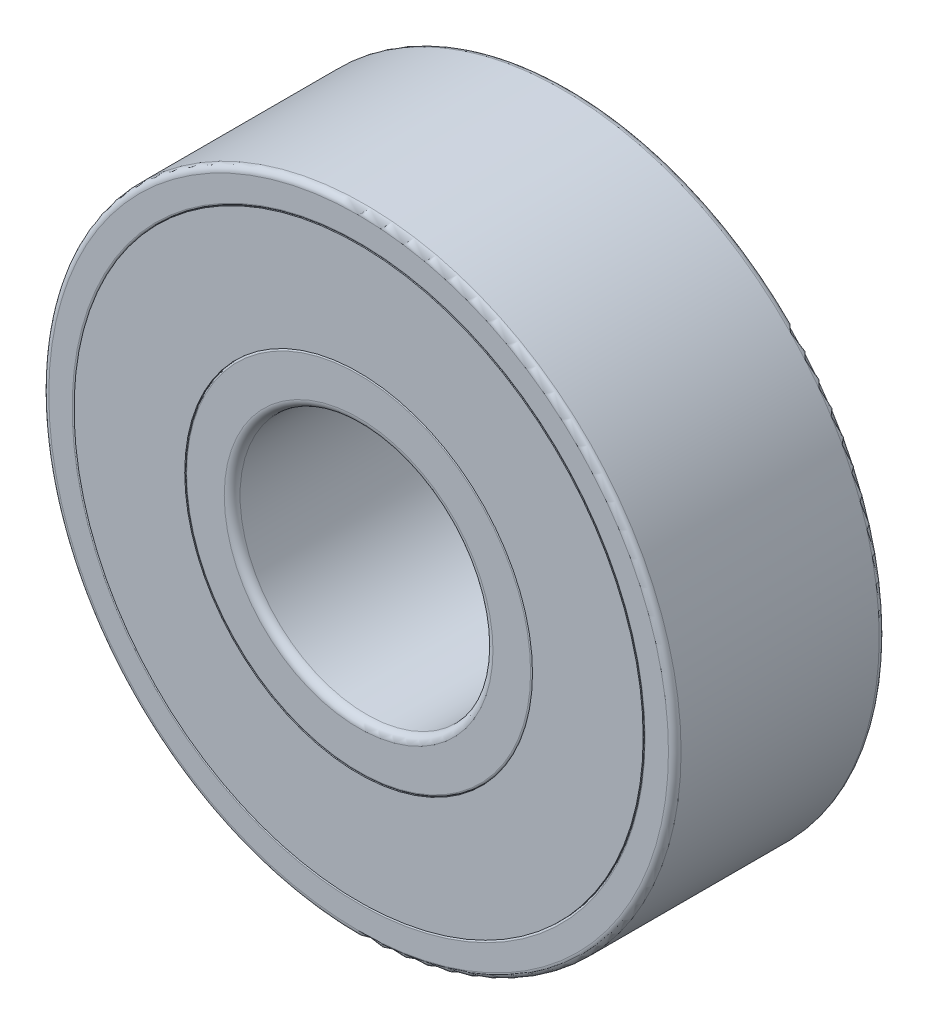
ISO-10303-21;
HEADER;
FILE_DESCRIPTION(('STEP AP214'),'2;1');
FILE_NAME('part.step','',(''),(''),'','','');
FILE_SCHEMA(('AUTOMOTIVE_DESIGN { 1 0 10303 214 1 1 1 1 }'));
ENDSEC;
DATA;
#1=APPLICATION_CONTEXT('core data for automotive mechanical design processes');
#2=APPLICATION_PROTOCOL_DEFINITION('international standard','automotive_design',2000,#1);
#3=PRODUCT_CONTEXT('',#1,'mechanical');
#4=PRODUCT('Part','Part','',(#3));
#5=PRODUCT_RELATED_PRODUCT_CATEGORY('part','',(#4));
#6=PRODUCT_DEFINITION_FORMATION('','',#4);
#7=PRODUCT_DEFINITION_CONTEXT('part definition',#1,'design');
#8=PRODUCT_DEFINITION('design','',#6,#7);
#9=PRODUCT_DEFINITION_SHAPE('','',#8);
#10=(LENGTH_UNIT() NAMED_UNIT(*) SI_UNIT(.MILLI.,.METRE.));
#11=(NAMED_UNIT(*) PLANE_ANGLE_UNIT() SI_UNIT($,.RADIAN.));
#12=(NAMED_UNIT(*) SI_UNIT($,.STERADIAN.) SOLID_ANGLE_UNIT());
#13=UNCERTAINTY_MEASURE_WITH_UNIT(LENGTH_MEASURE(1.E-05),#10,'distance_accuracy_value','');
#14=(GEOMETRIC_REPRESENTATION_CONTEXT(3) GLOBAL_UNCERTAINTY_ASSIGNED_CONTEXT((#13)) GLOBAL_UNIT_ASSIGNED_CONTEXT((#10,
#11,#12)) REPRESENTATION_CONTEXT('',''));
#15=CARTESIAN_POINT('',(0.,0.,0.));
#16=DIRECTION('',(0.,0.,1.));
#17=DIRECTION('',(1.,0.,0.));
#18=AXIS2_PLACEMENT_3D('',#15,#16,#17);
#19=CARTESIAN_POINT('',(0.,0.,2.5));
#20=DIRECTION('',(0.,0.,1.));
#21=DIRECTION('',(1.,0.,0.));
#22=AXIS2_PLACEMENT_3D('',#19,#20,#21);
#23=PLANE('',#22);
#24=CARTESIAN_POINT('',(0.,0.,2.5));
#25=DIRECTION('',(0.,0.,1.));
#26=DIRECTION('',(1.,0.,0.));
#27=AXIS2_PLACEMENT_3D('',#24,#25,#26);
#28=CIRCLE('',#27,6.75);
#29=CARTESIAN_POINT('',(6.75,0.,2.5));
#30=VERTEX_POINT('',#29);
#31=EDGE_CURVE('E11',#30,#30,#28,.T.);
#32=ORIENTED_EDGE('',*,*,#31,.T.);
#33=EDGE_LOOP('',(#32));
#34=FACE_BOUND('',#33,.T.);
#35=CARTESIAN_POINT('',(0.,0.,2.5));
#36=DIRECTION('',(0.,0.,1.));
#37=DIRECTION('',(1.,0.,0.));
#38=AXIS2_PLACEMENT_3D('',#35,#36,#37);
#39=CIRCLE('',#38,4.125);
#40=CARTESIAN_POINT('',(4.125,0.,2.5));
#41=VERTEX_POINT('',#40);
#42=EDGE_CURVE('E55',#41,#41,#39,.T.);
#43=ORIENTED_EDGE('',*,*,#42,.F.);
#44=EDGE_LOOP('',(#43));
#45=FACE_BOUND('',#44,.T.);
#46=ADVANCED_FACE('F44',(#34,#45),#23,.T.);
#47=CARTESIAN_POINT('',(0.,0.,-2.5));
#48=DIRECTION('',(0.,0.,1.));
#49=DIRECTION('',(1.,0.,0.));
#50=AXIS2_PLACEMENT_3D('',#47,#48,#49);
#51=PLANE('',#50);
#52=CARTESIAN_POINT('',(0.,0.,-2.5));
#53=DIRECTION('',(0.,0.,1.));
#54=DIRECTION('',(1.,0.,0.));
#55=AXIS2_PLACEMENT_3D('',#52,#53,#54);
#56=CIRCLE('',#55,6.75);
#57=CARTESIAN_POINT('',(6.75,0.,-2.5));
#58=VERTEX_POINT('',#57);
#59=EDGE_CURVE('E48',#58,#58,#56,.T.);
#60=ORIENTED_EDGE('',*,*,#59,.F.);
#61=EDGE_LOOP('',(#60));
#62=FACE_BOUND('',#61,.T.);
#63=CARTESIAN_POINT('',(0.,0.,-2.5));
#64=DIRECTION('',(0.,0.,1.));
#65=DIRECTION('',(1.,0.,0.));
#66=AXIS2_PLACEMENT_3D('',#63,#64,#65);
#67=CIRCLE('',#66,4.125);
#68=CARTESIAN_POINT('',(4.125,0.,-2.5));
#69=VERTEX_POINT('',#68);
#70=EDGE_CURVE('E57',#69,#69,#67,.T.);
#71=ORIENTED_EDGE('',*,*,#70,.T.);
#72=EDGE_LOOP('',(#71));
#73=FACE_BOUND('',#72,.T.);
#74=ADVANCED_FACE('F67',(#62,#73),#51,.F.);
#75=CARTESIAN_POINT('',(0.,0.,2.5));
#76=DIRECTION('',(0.,0.,-1.));
#77=DIRECTION('',(-1.,0.,0.));
#78=AXIS2_PLACEMENT_3D('',#75,#76,#77);
#79=CYLINDRICAL_SURFACE('',#78,6.75);
#80=ORIENTED_EDGE('',*,*,#31,.F.);
#81=EDGE_LOOP('',(#80));
#82=FACE_BOUND('',#81,.T.);
#83=ORIENTED_EDGE('',*,*,#59,.T.);
#84=EDGE_LOOP('',(#83));
#85=FACE_BOUND('',#84,.T.);
#86=ADVANCED_FACE('F46',(#82,#85),#79,.T.);
#87=CARTESIAN_POINT('',(0.,0.,2.5));
#88=DIRECTION('',(0.,0.,-1.));
#89=DIRECTION('',(-1.,0.,0.));
#90=AXIS2_PLACEMENT_3D('',#87,#88,#89);
#91=CYLINDRICAL_SURFACE('',#90,4.125);
#92=ORIENTED_EDGE('',*,*,#42,.T.);
#93=EDGE_LOOP('',(#92));
#94=FACE_BOUND('',#93,.T.);
#95=ORIENTED_EDGE('',*,*,#70,.F.);
#96=EDGE_LOOP('',(#95));
#97=FACE_BOUND('',#96,.T.);
#98=ADVANCED_FACE('F63',(#94,#97),#91,.F.);
#99=CLOSED_SHELL('',(#46,#74,#86,#98));
#100=MANIFOLD_SOLID_BREP('B2',#99);
#101=CARTESIAN_POINT('',(4.25120868591987,-3.39022579760692,0.));
#102=DIRECTION('',(-0.781831482468022,0.623489801858743,0.));
#103=DIRECTION('',(0.,0.,-1.));
#104=AXIS2_PLACEMENT_3D('',#101,#102,#103);
#105=SPHERICAL_SURFACE('',#104,1.575);
#106=CARTESIAN_POINT('',(3.01982410103274,-2.4082293596794,0.));
#107=VERTEX_POINT('',#106);
#108=VERTEX_LOOP('',#107);
#109=FACE_BOUND('',#108,.T.);
#110=ADVANCED_FACE('F112',(#109),#105,.T.);
#111=CLOSED_SHELL('',(#110));
#112=MANIFOLD_SOLID_BREP('B6',#111);
#113=CARTESIAN_POINT('',(5.30117052248868,1.20995757838741,0.));
#114=DIRECTION('',(-0.974927912181826,-0.222520933956305,0.));
#115=DIRECTION('',(0.,0.,-1.));
#116=AXIS2_PLACEMENT_3D('',#113,#114,#115);
#117=SPHERICAL_SURFACE('',#116,1.575);
#118=CARTESIAN_POINT('',(3.7656590608023,0.859487107406228,0.));
#119=VERTEX_POINT('',#118);
#120=VERTEX_LOOP('',#119);
#121=FACE_BOUND('',#120,.T.);
#122=ADVANCED_FACE('F131',(#121),#117,.T.);
#123=CLOSED_SHELL('',(#122));
#124=MANIFOLD_SOLID_BREP('B40',#123);
#125=CARTESIAN_POINT('',(2.35924283145176,4.89901821921939,0.));
#126=DIRECTION('',(-0.433883739117565,-0.900968867902416,0.));
#127=DIRECTION('',(0.,0.,-1.));
#128=AXIS2_PLACEMENT_3D('',#125,#126,#127);
#129=SPHERICAL_SURFACE('',#128,1.575);
#130=CARTESIAN_POINT('',(1.6758759423416,3.47999225227308,0.));
#131=VERTEX_POINT('',#130);
#132=VERTEX_LOOP('',#131);
#133=FACE_BOUND('',#132,.T.);
#134=ADVANCED_FACE('F150',(#133),#129,.T.);
#135=CLOSED_SHELL('',(#134));
#136=MANIFOLD_SOLID_BREP('B108',#135);
#137=CARTESIAN_POINT('',(-2.35924283145169,4.89901821921942,0.));
#138=DIRECTION('',(0.433883739117553,-0.900968867902422,0.));
#139=DIRECTION('',(0.,0.,-1.));
#140=AXIS2_PLACEMENT_3D('',#137,#138,#139);
#141=SPHERICAL_SURFACE('',#140,1.575);
#142=CARTESIAN_POINT('',(-1.67587594234155,3.4799922522731,0.));
#143=VERTEX_POINT('',#142);
#144=VERTEX_LOOP('',#143);
#145=FACE_BOUND('',#144,.T.);
#146=ADVANCED_FACE('F169',(#145),#141,.T.);
#147=CLOSED_SHELL('',(#146));
#148=MANIFOLD_SOLID_BREP('B127',#147);
#149=CARTESIAN_POINT('',(-5.30117052248866,1.20995757838748,0.));
#150=DIRECTION('',(0.974927912181823,-0.222520933956318,0.));
#151=DIRECTION('',(0.,0.,-1.));
#152=AXIS2_PLACEMENT_3D('',#149,#150,#151);
#153=SPHERICAL_SURFACE('',#152,1.575);
#154=CARTESIAN_POINT('',(-3.76565906080229,0.859487107406279,0.));
#155=VERTEX_POINT('',#154);
#156=VERTEX_LOOP('',#155);
#157=FACE_BOUND('',#156,.T.);
#158=ADVANCED_FACE('F188',(#157),#153,.T.);
#159=CLOSED_SHELL('',(#158));
#160=MANIFOLD_SOLID_BREP('B146',#159);
#161=CARTESIAN_POINT('',(-4.25120868591992,-3.39022579760686,0.));
#162=DIRECTION('',(0.781831482468031,0.623489801858732,0.));
#163=DIRECTION('',(0.,0.,-1.));
#164=AXIS2_PLACEMENT_3D('',#161,#162,#163);
#165=SPHERICAL_SURFACE('',#164,1.575);
#166=CARTESIAN_POINT('',(-3.01982410103277,-2.40822935967935,0.));
#167=VERTEX_POINT('',#166);
#168=VERTEX_LOOP('',#167);
#169=FACE_BOUND('',#168,.T.);
#170=ADVANCED_FACE('F207',(#169),#165,.T.);
#171=CLOSED_SHELL('',(#170));
#172=MANIFOLD_SOLID_BREP('B165',#171);
#173=CARTESIAN_POINT('',(0.,-5.4375,0.));
#174=DIRECTION('',(0.,1.,0.));
#175=DIRECTION('',(0.,0.,-1.));
#176=AXIS2_PLACEMENT_3D('',#173,#174,#175);
#177=SPHERICAL_SURFACE('',#176,1.575);
#178=CARTESIAN_POINT('',(0.,-3.8625,0.));
#179=VERTEX_POINT('',#178);
#180=VERTEX_LOOP('',#179);
#181=FACE_BOUND('',#180,.T.);
#182=ADVANCED_FACE('F228',(#181),#177,.T.);
#183=CLOSED_SHELL('',(#182));
#184=MANIFOLD_SOLID_BREP('B184',#183);
#185=CARTESIAN_POINT('',(0.,0.,2.5));
#186=DIRECTION('',(0.,0.,1.));
#187=DIRECTION('',(1.,0.,0.));
#188=AXIS2_PLACEMENT_3D('',#185,#186,#187);
#189=CYLINDRICAL_SURFACE('',#188,4.125);
#190=CARTESIAN_POINT('',(0.,0.,2.455));
#191=DIRECTION('',(0.,0.,1.));
#192=DIRECTION('',(1.,0.,0.));
#193=AXIS2_PLACEMENT_3D('',#190,#191,#192);
#194=CIRCLE('',#193,4.125);
#195=CARTESIAN_POINT('',(4.125,0.,2.455));
#196=VERTEX_POINT('',#195);
#197=EDGE_CURVE('E227',#196,#196,#194,.F.);
#198=ORIENTED_EDGE('',*,*,#197,.T.);
#199=EDGE_LOOP('',(#198));
#200=FACE_BOUND('',#199,.T.);
#201=CARTESIAN_POINT('',(0.,0.,0.870614007468293));
#202=DIRECTION('',(0.,0.,-1.));
#203=DIRECTION('',(-1.,0.,0.));
#204=AXIS2_PLACEMENT_3D('',#201,#202,#203);
#205=CIRCLE('',#204,4.125);
#206=CARTESIAN_POINT('',(-4.125,0.,0.870614007468293));
#207=VERTEX_POINT('',#206);
#208=EDGE_CURVE('E280',#207,#207,#205,.T.);
#209=ORIENTED_EDGE('',*,*,#208,.F.);
#210=EDGE_LOOP('',(#209));
#211=FACE_BOUND('',#210,.T.);
#212=ADVANCED_FACE('F248',(#200,#211),#189,.T.);
#213=CARTESIAN_POINT('',(0.,-4.125,2.5));
#214=DIRECTION('',(0.,0.,1.));
#215=DIRECTION('',(1.,0.,0.));
#216=AXIS2_PLACEMENT_3D('',#213,#214,#215);
#217=PLANE('',#216);
#218=CARTESIAN_POINT('',(0.,0.,2.5));
#219=DIRECTION('',(0.,0.,1.));
#220=DIRECTION('',(1.,0.,0.));
#221=AXIS2_PLACEMENT_3D('',#218,#219,#220);
#222=CIRCLE('',#221,4.08);
#223=CARTESIAN_POINT('',(4.08,0.,2.5));
#224=VERTEX_POINT('',#223);
#225=EDGE_CURVE('E255',#224,#224,#222,.T.);
#226=ORIENTED_EDGE('',*,*,#225,.T.);
#227=EDGE_LOOP('',(#226));
#228=FACE_BOUND('',#227,.T.);
#229=CARTESIAN_POINT('',(0.,0.,2.5));
#230=DIRECTION('',(0.,0.,1.));
#231=DIRECTION('',(1.,0.,0.));
#232=AXIS2_PLACEMENT_3D('',#229,#230,#231);
#233=CIRCLE('',#232,3.1875);
#234=CARTESIAN_POINT('',(3.1875,0.,2.5));
#235=VERTEX_POINT('',#234);
#236=EDGE_CURVE('E268',#235,#235,#233,.F.);
#237=ORIENTED_EDGE('',*,*,#236,.T.);
#238=EDGE_LOOP('',(#237));
#239=FACE_BOUND('',#238,.T.);
#240=ADVANCED_FACE('F305',(#228,#239),#217,.T.);
#241=CARTESIAN_POINT('',(0.,0.,2.5));
#242=DIRECTION('',(0.,0.,1.));
#243=DIRECTION('',(1.,0.,0.));
#244=AXIS2_PLACEMENT_3D('',#241,#242,#243);
#245=CYLINDRICAL_SURFACE('',#244,3.);
#246=CARTESIAN_POINT('',(0.,0.,-2.3125));
#247=DIRECTION('',(0.,0.,-1.));
#248=DIRECTION('',(-1.,0.,0.));
#249=AXIS2_PLACEMENT_3D('',#246,#247,#248);
#250=CIRCLE('',#249,3.);
#251=CARTESIAN_POINT('',(-3.,0.,-2.3125));
#252=VERTEX_POINT('',#251);
#253=EDGE_CURVE('E271',#252,#252,#250,.T.);
#254=ORIENTED_EDGE('',*,*,#253,.T.);
#255=EDGE_LOOP('',(#254));
#256=FACE_BOUND('',#255,.T.);
#257=CARTESIAN_POINT('',(0.,0.,2.3125));
#258=DIRECTION('',(0.,0.,1.));
#259=DIRECTION('',(1.,0.,0.));
#260=AXIS2_PLACEMENT_3D('',#257,#258,#259);
#261=CIRCLE('',#260,3.);
#262=CARTESIAN_POINT('',(3.,0.,2.3125));
#263=VERTEX_POINT('',#262);
#264=EDGE_CURVE('E274',#263,#263,#261,.T.);
#265=ORIENTED_EDGE('',*,*,#264,.T.);
#266=EDGE_LOOP('',(#265));
#267=FACE_BOUND('',#266,.T.);
#268=ADVANCED_FACE('F301',(#256,#267),#245,.F.);
#269=CARTESIAN_POINT('',(0.,-4.125,-2.5));
#270=DIRECTION('',(0.,0.,-1.));
#271=DIRECTION('',(-1.,0.,0.));
#272=AXIS2_PLACEMENT_3D('',#269,#270,#271);
#273=PLANE('',#272);
#274=CARTESIAN_POINT('',(0.,0.,-2.5));
#275=DIRECTION('',(0.,0.,-1.));
#276=DIRECTION('',(-1.,0.,0.));
#277=AXIS2_PLACEMENT_3D('',#274,#275,#276);
#278=CIRCLE('',#277,4.08);
#279=CARTESIAN_POINT('',(-4.08,0.,-2.5));
#280=VERTEX_POINT('',#279);
#281=EDGE_CURVE('E259',#280,#280,#278,.T.);
#282=ORIENTED_EDGE('',*,*,#281,.T.);
#283=EDGE_LOOP('',(#282));
#284=FACE_BOUND('',#283,.T.);
#285=CARTESIAN_POINT('',(0.,0.,-2.5));
#286=DIRECTION('',(0.,0.,-1.));
#287=DIRECTION('',(-1.,0.,0.));
#288=AXIS2_PLACEMENT_3D('',#285,#286,#287);
#289=CIRCLE('',#288,3.1875);
#290=CARTESIAN_POINT('',(-3.1875,0.,-2.5));
#291=VERTEX_POINT('',#290);
#292=EDGE_CURVE('E277',#291,#291,#289,.F.);
#293=ORIENTED_EDGE('',*,*,#292,.T.);
#294=EDGE_LOOP('',(#293));
#295=FACE_BOUND('',#294,.T.);
#296=ADVANCED_FACE('F291',(#284,#295),#273,.T.);
#297=CARTESIAN_POINT('',(0.,0.,-2.455));
#298=DIRECTION('',(0.,0.,-1.));
#299=DIRECTION('',(-1.,0.,0.));
#300=AXIS2_PLACEMENT_3D('',#297,#298,#299);
#301=CIRCLE('',#300,4.125);
#302=CARTESIAN_POINT('',(-4.125,0.,-2.455));
#303=VERTEX_POINT('',#302);
#304=EDGE_CURVE('E263',#303,#303,#301,.F.);
#305=ORIENTED_EDGE('',*,*,#304,.T.);
#306=EDGE_LOOP('',(#305));
#307=FACE_BOUND('',#306,.T.);
#308=CARTESIAN_POINT('',(0.,0.,-0.870614007468293));
#309=DIRECTION('',(0.,0.,1.));
#310=DIRECTION('',(1.,0.,0.));
#311=AXIS2_PLACEMENT_3D('',#308,#309,#310);
#312=CIRCLE('',#311,4.125);
#313=CARTESIAN_POINT('',(4.125,0.,-0.870614007468293));
#314=VERTEX_POINT('',#313);
#315=EDGE_CURVE('E283',#314,#314,#312,.T.);
#316=ORIENTED_EDGE('',*,*,#315,.F.);
#317=EDGE_LOOP('',(#316));
#318=FACE_BOUND('',#317,.T.);
#319=ADVANCED_FACE('F289',(#307,#318),#189,.T.);
#320=CARTESIAN_POINT('',(0.,0.,0.));
#321=DIRECTION('',(0.,0.,1.));
#322=DIRECTION('',(1.,0.,0.));
#323=AXIS2_PLACEMENT_3D('',#320,#321,#322);
#324=TOROIDAL_SURFACE('',#323,5.4375,1.575);
#325=ORIENTED_EDGE('',*,*,#208,.T.);
#326=EDGE_LOOP('',(#325));
#327=FACE_BOUND('',#326,.T.);
#328=ORIENTED_EDGE('',*,*,#315,.T.);
#329=EDGE_LOOP('',(#328));
#330=FACE_BOUND('',#329,.T.);
#331=ADVANCED_FACE('F287',(#327,#330),#324,.F.);
#332=CARTESIAN_POINT('',(0.,0.,-2.3125));
#333=DIRECTION('',(0.,0.,-1.));
#334=DIRECTION('',(-1.,0.,0.));
#335=AXIS2_PLACEMENT_3D('',#332,#333,#334);
#336=TOROIDAL_SURFACE('',#335,3.1875,0.1875);
#337=ORIENTED_EDGE('',*,*,#253,.F.);
#338=EDGE_LOOP('',(#337));
#339=FACE_BOUND('',#338,.T.);
#340=ORIENTED_EDGE('',*,*,#292,.F.);
#341=EDGE_LOOP('',(#340));
#342=FACE_BOUND('',#341,.T.);
#343=ADVANCED_FACE('F298',(#339,#342),#336,.T.);
#344=CARTESIAN_POINT('',(0.,0.,2.3125));
#345=DIRECTION('',(0.,0.,1.));
#346=DIRECTION('',(1.,0.,0.));
#347=AXIS2_PLACEMENT_3D('',#344,#345,#346);
#348=TOROIDAL_SURFACE('',#347,3.1875,0.1875);
#349=ORIENTED_EDGE('',*,*,#236,.F.);
#350=EDGE_LOOP('',(#349));
#351=FACE_BOUND('',#350,.T.);
#352=ORIENTED_EDGE('',*,*,#264,.F.);
#353=EDGE_LOOP('',(#352));
#354=FACE_BOUND('',#353,.T.);
#355=ADVANCED_FACE('F321',(#351,#354),#348,.T.);
#356=CARTESIAN_POINT('',(0.,0.,-2.455));
#357=DIRECTION('',(0.,0.,-1.));
#358=DIRECTION('',(-1.,0.,0.));
#359=AXIS2_PLACEMENT_3D('',#356,#357,#358);
#360=TOROIDAL_SURFACE('',#359,4.08,0.045);
#361=ORIENTED_EDGE('',*,*,#281,.F.);
#362=EDGE_LOOP('',(#361));
#363=FACE_BOUND('',#362,.T.);
#364=ORIENTED_EDGE('',*,*,#304,.F.);
#365=EDGE_LOOP('',(#364));
#366=FACE_BOUND('',#365,.T.);
#367=ADVANCED_FACE('F324',(#363,#366),#360,.T.);
#368=CARTESIAN_POINT('',(0.,0.,2.455));
#369=DIRECTION('',(0.,0.,1.));
#370=DIRECTION('',(1.,0.,0.));
#371=AXIS2_PLACEMENT_3D('',#368,#369,#370);
#372=TOROIDAL_SURFACE('',#371,4.08,0.045);
#373=ORIENTED_EDGE('',*,*,#197,.F.);
#374=EDGE_LOOP('',(#373));
#375=FACE_BOUND('',#374,.T.);
#376=ORIENTED_EDGE('',*,*,#225,.F.);
#377=EDGE_LOOP('',(#376));
#378=FACE_BOUND('',#377,.T.);
#379=ADVANCED_FACE('F250',(#375,#378),#372,.T.);
#380=CLOSED_SHELL('',(#212,#240,#268,#296,#319,#331,#343,#355,#367,#379));
#381=MANIFOLD_SOLID_BREP('B203',#380);
#382=CARTESIAN_POINT('',(0.,0.,2.5));
#383=DIRECTION('',(0.,0.,1.));
#384=DIRECTION('',(1.,0.,0.));
#385=AXIS2_PLACEMENT_3D('',#382,#383,#384);
#386=CYLINDRICAL_SURFACE('',#385,6.75);
#387=CARTESIAN_POINT('',(0.,0.,2.455));
#388=DIRECTION('',(0.,0.,1.));
#389=DIRECTION('',(1.,0.,0.));
#390=AXIS2_PLACEMENT_3D('',#387,#388,#389);
#391=CIRCLE('',#390,6.75);
#392=CARTESIAN_POINT('',(6.75,0.,2.455));
#393=VERTEX_POINT('',#392);
#394=EDGE_CURVE('E406',#393,#393,#391,.T.);
#395=ORIENTED_EDGE('',*,*,#394,.T.);
#396=EDGE_LOOP('',(#395));
#397=FACE_BOUND('',#396,.T.);
#398=CARTESIAN_POINT('',(0.,0.,0.870614007468294));
#399=DIRECTION('',(0.,0.,-1.));
#400=DIRECTION('',(-1.,0.,0.));
#401=AXIS2_PLACEMENT_3D('',#398,#399,#400);
#402=CIRCLE('',#401,6.75);
#403=CARTESIAN_POINT('',(-6.75,0.,0.870614007468294));
#404=VERTEX_POINT('',#403);
#405=EDGE_CURVE('E431',#404,#404,#402,.F.);
#406=ORIENTED_EDGE('',*,*,#405,.F.);
#407=EDGE_LOOP('',(#406));
#408=FACE_BOUND('',#407,.T.);
#409=ADVANCED_FACE('F399',(#397,#408),#386,.F.);
#410=CARTESIAN_POINT('',(0.,-6.75,2.5));
#411=DIRECTION('',(0.,0.,1.));
#412=DIRECTION('',(1.,0.,0.));
#413=AXIS2_PLACEMENT_3D('',#410,#411,#412);
#414=PLANE('',#413);
#415=CARTESIAN_POINT('',(0.,0.,2.5));
#416=DIRECTION('',(0.,0.,1.));
#417=DIRECTION('',(1.,0.,0.));
#418=AXIS2_PLACEMENT_3D('',#415,#416,#417);
#419=CIRCLE('',#418,6.795);
#420=CARTESIAN_POINT('',(6.795,0.,2.5));
#421=VERTEX_POINT('',#420);
#422=EDGE_CURVE('E247',#421,#421,#419,.F.);
#423=ORIENTED_EDGE('',*,*,#422,.T.);
#424=EDGE_LOOP('',(#423));
#425=FACE_BOUND('',#424,.T.);
#426=CARTESIAN_POINT('',(0.,0.,2.5));
#427=DIRECTION('',(0.,0.,1.));
#428=DIRECTION('',(1.,0.,0.));
#429=AXIS2_PLACEMENT_3D('',#426,#427,#428);
#430=CIRCLE('',#429,7.35);
#431=CARTESIAN_POINT('',(7.35,0.,2.5));
#432=VERTEX_POINT('',#431);
#433=EDGE_CURVE('E419',#432,#432,#430,.T.);
#434=ORIENTED_EDGE('',*,*,#433,.T.);
#435=EDGE_LOOP('',(#434));
#436=FACE_BOUND('',#435,.T.);
#437=ADVANCED_FACE('F456',(#425,#436),#414,.T.);
#438=CARTESIAN_POINT('',(0.,0.,2.5));
#439=DIRECTION('',(0.,0.,1.));
#440=DIRECTION('',(1.,0.,0.));
#441=AXIS2_PLACEMENT_3D('',#438,#439,#440);
#442=CYLINDRICAL_SURFACE('',#441,7.5);
#443=CARTESIAN_POINT('',(0.,0.,-2.35));
#444=DIRECTION('',(0.,0.,-1.));
#445=DIRECTION('',(-1.,0.,0.));
#446=AXIS2_PLACEMENT_3D('',#443,#444,#445);
#447=CIRCLE('',#446,7.5);
#448=CARTESIAN_POINT('',(-7.5,0.,-2.35));
#449=VERTEX_POINT('',#448);
#450=EDGE_CURVE('E425',#449,#449,#447,.F.);
#451=ORIENTED_EDGE('',*,*,#450,.T.);
#452=EDGE_LOOP('',(#451));
#453=FACE_BOUND('',#452,.T.);
#454=CARTESIAN_POINT('',(0.,0.,2.35));
#455=DIRECTION('',(0.,0.,1.));
#456=DIRECTION('',(1.,0.,0.));
#457=AXIS2_PLACEMENT_3D('',#454,#455,#456);
#458=CIRCLE('',#457,7.5);
#459=CARTESIAN_POINT('',(7.5,0.,2.35));
#460=VERTEX_POINT('',#459);
#461=EDGE_CURVE('E428',#460,#460,#458,.F.);
#462=ORIENTED_EDGE('',*,*,#461,.T.);
#463=EDGE_LOOP('',(#462));
#464=FACE_BOUND('',#463,.T.);
#465=ADVANCED_FACE('F452',(#453,#464),#442,.T.);
#466=CARTESIAN_POINT('',(0.,-7.5,-2.5));
#467=DIRECTION('',(0.,0.,-1.));
#468=DIRECTION('',(-1.,0.,0.));
#469=AXIS2_PLACEMENT_3D('',#466,#467,#468);
#470=PLANE('',#469);
#471=CARTESIAN_POINT('',(0.,0.,-2.5));
#472=DIRECTION('',(0.,0.,-1.));
#473=DIRECTION('',(-1.,0.,0.));
#474=AXIS2_PLACEMENT_3D('',#471,#472,#473);
#475=CIRCLE('',#474,6.795);
#476=CARTESIAN_POINT('',(-6.795,0.,-2.5));
#477=VERTEX_POINT('',#476);
#478=EDGE_CURVE('E414',#477,#477,#475,.F.);
#479=ORIENTED_EDGE('',*,*,#478,.T.);
#480=EDGE_LOOP('',(#479));
#481=FACE_BOUND('',#480,.T.);
#482=CARTESIAN_POINT('',(0.,0.,-2.5));
#483=DIRECTION('',(0.,0.,-1.));
#484=DIRECTION('',(-1.,0.,0.));
#485=AXIS2_PLACEMENT_3D('',#482,#483,#484);
#486=CIRCLE('',#485,7.35);
#487=CARTESIAN_POINT('',(-7.35,0.,-2.5));
#488=VERTEX_POINT('',#487);
#489=EDGE_CURVE('E422',#488,#488,#486,.T.);
#490=ORIENTED_EDGE('',*,*,#489,.T.);
#491=EDGE_LOOP('',(#490));
#492=FACE_BOUND('',#491,.T.);
#493=ADVANCED_FACE('F442',(#481,#492),#470,.T.);
#494=CARTESIAN_POINT('',(0.,0.,-2.455));
#495=DIRECTION('',(0.,0.,-1.));
#496=DIRECTION('',(-1.,0.,0.));
#497=AXIS2_PLACEMENT_3D('',#494,#495,#496);
#498=CIRCLE('',#497,6.75);
#499=CARTESIAN_POINT('',(-6.75,0.,-2.455));
#500=VERTEX_POINT('',#499);
#501=EDGE_CURVE('E410',#500,#500,#498,.T.);
#502=ORIENTED_EDGE('',*,*,#501,.T.);
#503=EDGE_LOOP('',(#502));
#504=FACE_BOUND('',#503,.T.);
#505=CARTESIAN_POINT('',(0.,0.,-0.870614007468294));
#506=DIRECTION('',(0.,0.,1.));
#507=DIRECTION('',(1.,0.,0.));
#508=AXIS2_PLACEMENT_3D('',#505,#506,#507);
#509=CIRCLE('',#508,6.75);
#510=CARTESIAN_POINT('',(6.75,0.,-0.870614007468294));
#511=VERTEX_POINT('',#510);
#512=EDGE_CURVE('E434',#511,#511,#509,.F.);
#513=ORIENTED_EDGE('',*,*,#512,.F.);
#514=EDGE_LOOP('',(#513));
#515=FACE_BOUND('',#514,.T.);
#516=ADVANCED_FACE('F440',(#504,#515),#386,.F.);
#517=CARTESIAN_POINT('',(0.,0.,0.));
#518=DIRECTION('',(0.,0.,1.));
#519=DIRECTION('',(1.,0.,0.));
#520=AXIS2_PLACEMENT_3D('',#517,#518,#519);
#521=TOROIDAL_SURFACE('',#520,5.4375,1.575);
#522=ORIENTED_EDGE('',*,*,#405,.T.);
#523=EDGE_LOOP('',(#522));
#524=FACE_BOUND('',#523,.T.);
#525=ORIENTED_EDGE('',*,*,#512,.T.);
#526=EDGE_LOOP('',(#525));
#527=FACE_BOUND('',#526,.T.);
#528=ADVANCED_FACE('F438',(#524,#527),#521,.F.);
#529=CARTESIAN_POINT('',(0.,0.,-2.35));
#530=DIRECTION('',(0.,0.,-1.));
#531=DIRECTION('',(-1.,0.,0.));
#532=AXIS2_PLACEMENT_3D('',#529,#530,#531);
#533=TOROIDAL_SURFACE('',#532,7.35,0.15);
#534=ORIENTED_EDGE('',*,*,#489,.F.);
#535=EDGE_LOOP('',(#534));
#536=FACE_BOUND('',#535,.T.);
#537=ORIENTED_EDGE('',*,*,#450,.F.);
#538=EDGE_LOOP('',(#537));
#539=FACE_BOUND('',#538,.T.);
#540=ADVANCED_FACE('F449',(#536,#539),#533,.T.);
#541=CARTESIAN_POINT('',(0.,0.,2.35));
#542=DIRECTION('',(0.,0.,1.));
#543=DIRECTION('',(1.,0.,0.));
#544=AXIS2_PLACEMENT_3D('',#541,#542,#543);
#545=TOROIDAL_SURFACE('',#544,7.35,0.15);
#546=ORIENTED_EDGE('',*,*,#461,.F.);
#547=EDGE_LOOP('',(#546));
#548=FACE_BOUND('',#547,.T.);
#549=ORIENTED_EDGE('',*,*,#433,.F.);
#550=EDGE_LOOP('',(#549));
#551=FACE_BOUND('',#550,.T.);
#552=ADVANCED_FACE('F472',(#548,#551),#545,.T.);
#553=CARTESIAN_POINT('',(0.,0.,-2.455));
#554=DIRECTION('',(0.,0.,-1.));
#555=DIRECTION('',(-1.,0.,0.));
#556=AXIS2_PLACEMENT_3D('',#553,#554,#555);
#557=TOROIDAL_SURFACE('',#556,6.795,0.045);
#558=ORIENTED_EDGE('',*,*,#501,.F.);
#559=EDGE_LOOP('',(#558));
#560=FACE_BOUND('',#559,.T.);
#561=ORIENTED_EDGE('',*,*,#478,.F.);
#562=EDGE_LOOP('',(#561));
#563=FACE_BOUND('',#562,.T.);
#564=ADVANCED_FACE('F475',(#560,#563),#557,.T.);
#565=CARTESIAN_POINT('',(0.,0.,2.455));
#566=DIRECTION('',(0.,0.,1.));
#567=DIRECTION('',(1.,0.,0.));
#568=AXIS2_PLACEMENT_3D('',#565,#566,#567);
#569=TOROIDAL_SURFACE('',#568,6.795,0.045);
#570=ORIENTED_EDGE('',*,*,#422,.F.);
#571=EDGE_LOOP('',(#570));
#572=FACE_BOUND('',#571,.T.);
#573=ORIENTED_EDGE('',*,*,#394,.F.);
#574=EDGE_LOOP('',(#573));
#575=FACE_BOUND('',#574,.T.);
#576=ADVANCED_FACE('F401',(#572,#575),#569,.T.);
#577=CLOSED_SHELL('',(#409,#437,#465,#493,#516,#528,#540,#552,#564,#576));
#578=MANIFOLD_SOLID_BREP('B222',#577);
#579=ADVANCED_BREP_SHAPE_REPRESENTATION('',(#18,#100,#112,#124,#136,#148,#160,#172,#184,#381,
#578),#14);
#580=SHAPE_DEFINITION_REPRESENTATION(#9,#579);
ENDSEC;
END-ISO-10303-21;
